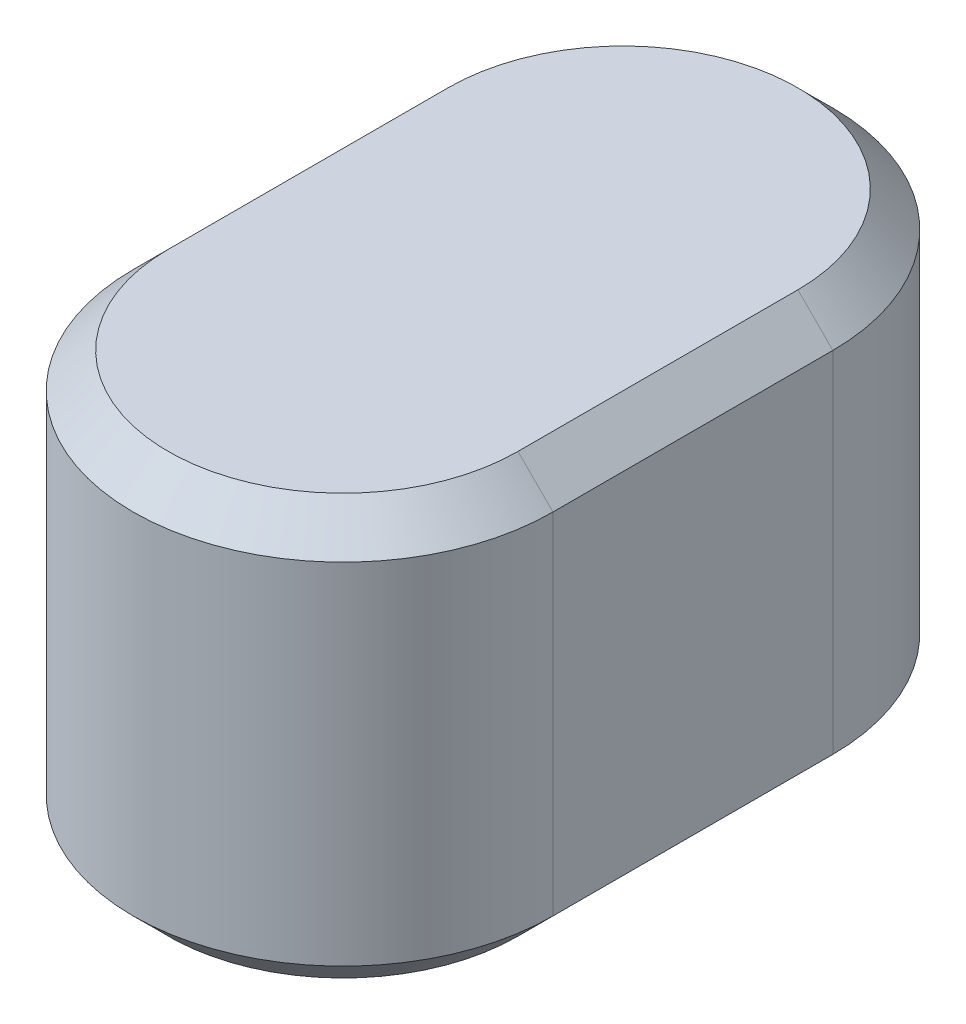
ISO-10303-21;
HEADER;
FILE_DESCRIPTION(('STEP AP214'),'2;1');
FILE_NAME('part.step','',(''),(''),'','','');
FILE_SCHEMA(('AUTOMOTIVE_DESIGN { 1 0 10303 214 1 1 1 1 }'));
ENDSEC;
DATA;
#1=APPLICATION_CONTEXT('core data for automotive mechanical design processes');
#2=APPLICATION_PROTOCOL_DEFINITION('international standard','automotive_design',2000,#1);
#3=PRODUCT_CONTEXT('',#1,'mechanical');
#4=PRODUCT('Part','Part','',(#3));
#5=PRODUCT_RELATED_PRODUCT_CATEGORY('part','',(#4));
#6=PRODUCT_DEFINITION_FORMATION('','',#4);
#7=PRODUCT_DEFINITION_CONTEXT('part definition',#1,'design');
#8=PRODUCT_DEFINITION('design','',#6,#7);
#9=PRODUCT_DEFINITION_SHAPE('','',#8);
#10=(LENGTH_UNIT() NAMED_UNIT(*) SI_UNIT(.MILLI.,.METRE.));
#11=(NAMED_UNIT(*) PLANE_ANGLE_UNIT() SI_UNIT($,.RADIAN.));
#12=(NAMED_UNIT(*) SI_UNIT($,.STERADIAN.) SOLID_ANGLE_UNIT());
#13=UNCERTAINTY_MEASURE_WITH_UNIT(LENGTH_MEASURE(1.E-05),#10,'distance_accuracy_value','');
#14=(GEOMETRIC_REPRESENTATION_CONTEXT(3) GLOBAL_UNCERTAINTY_ASSIGNED_CONTEXT((#13)) GLOBAL_UNIT_ASSIGNED_CONTEXT((#10,
#11,#12)) REPRESENTATION_CONTEXT('',''));
#15=CARTESIAN_POINT('',(0.,0.,0.));
#16=DIRECTION('',(0.,0.,1.));
#17=DIRECTION('',(1.,0.,0.));
#18=AXIS2_PLACEMENT_3D('',#15,#16,#17);
#19=CARTESIAN_POINT('',(0.,12.,0.));
#20=DIRECTION('',(0.,-1.,0.));
#21=DIRECTION('',(0.,0.,-1.));
#22=AXIS2_PLACEMENT_3D('',#19,#20,#21);
#23=CYLINDRICAL_SURFACE('',#22,6.);
#24=DIRECTION('',(0.,-1.,0.));
#25=VECTOR('',#24,1.);
#26=CARTESIAN_POINT('',(-6.,12.,0.));
#27=LINE('',#26,#25);
#28=CARTESIAN_POINT('',(-6.,11.,0.));
#29=VERTEX_POINT('',#28);
#30=CARTESIAN_POINT('',(-6.,1.,0.));
#31=VERTEX_POINT('',#30);
#32=EDGE_CURVE('E119',#29,#31,#27,.T.);
#33=ORIENTED_EDGE('',*,*,#32,.T.);
#34=CARTESIAN_POINT('',(0.,1.,0.));
#35=DIRECTION('',(0.,-1.,0.));
#36=DIRECTION('',(0.,0.,-1.));
#37=AXIS2_PLACEMENT_3D('',#34,#35,#36);
#38=CIRCLE('',#37,6.);
#39=CARTESIAN_POINT('',(6.,1.,0.));
#40=VERTEX_POINT('',#39);
#41=EDGE_CURVE('E126',#31,#40,#38,.F.);
#42=ORIENTED_EDGE('',*,*,#41,.T.);
#43=DIRECTION('',(0.,-1.,0.));
#44=VECTOR('',#43,1.);
#45=CARTESIAN_POINT('',(6.,12.,0.));
#46=LINE('',#45,#44);
#47=CARTESIAN_POINT('',(6.,11.,0.));
#48=VERTEX_POINT('',#47);
#49=EDGE_CURVE('E121',#48,#40,#46,.T.);
#50=ORIENTED_EDGE('',*,*,#49,.F.);
#51=CARTESIAN_POINT('',(0.,11.,0.));
#52=DIRECTION('',(0.,-1.,0.));
#53=DIRECTION('',(0.,0.,-1.));
#54=AXIS2_PLACEMENT_3D('',#51,#52,#53);
#55=CIRCLE('',#54,6.);
#56=EDGE_CURVE('E117',#48,#29,#55,.T.);
#57=ORIENTED_EDGE('',*,*,#56,.T.);
#58=EDGE_LOOP('',(#33,#42,#50,#57));
#59=FACE_BOUND('',#58,.T.);
#60=ADVANCED_FACE('F45',(#59),#23,.T.);
#61=CARTESIAN_POINT('',(6.,12.,0.));
#62=DIRECTION('',(-1.,0.,0.));
#63=DIRECTION('',(0.,0.,1.));
#64=AXIS2_PLACEMENT_3D('',#61,#62,#63);
#65=PLANE('',#64);
#66=ORIENTED_EDGE('',*,*,#49,.T.);
#67=DIRECTION('',(0.,0.,-1.));
#68=VECTOR('',#67,1.);
#69=CARTESIAN_POINT('',(6.,1.,-8.));
#70=LINE('',#69,#68);
#71=CARTESIAN_POINT('',(6.,1.,-8.));
#72=VERTEX_POINT('',#71);
#73=EDGE_CURVE('E192',#40,#72,#70,.T.);
#74=ORIENTED_EDGE('',*,*,#73,.T.);
#75=DIRECTION('',(0.,-1.,0.));
#76=VECTOR('',#75,1.);
#77=CARTESIAN_POINT('',(6.,12.,-8.));
#78=LINE('',#77,#76);
#79=CARTESIAN_POINT('',(6.,11.,-8.));
#80=VERTEX_POINT('',#79);
#81=EDGE_CURVE('E233',#80,#72,#78,.T.);
#82=ORIENTED_EDGE('',*,*,#81,.F.);
#83=DIRECTION('',(0.,0.,1.));
#84=VECTOR('',#83,1.);
#85=CARTESIAN_POINT('',(6.,11.,0.));
#86=LINE('',#85,#84);
#87=EDGE_CURVE('E214',#80,#48,#86,.T.);
#88=ORIENTED_EDGE('',*,*,#87,.T.);
#89=EDGE_LOOP('',(#66,#74,#82,#88));
#90=FACE_BOUND('',#89,.T.);
#91=ADVANCED_FACE('F235',(#90),#65,.F.);
#92=CARTESIAN_POINT('',(0.,12.,-8.));
#93=DIRECTION('',(0.,-1.,0.));
#94=DIRECTION('',(0.,0.,-1.));
#95=AXIS2_PLACEMENT_3D('',#92,#93,#94);
#96=CYLINDRICAL_SURFACE('',#95,6.);
#97=ORIENTED_EDGE('',*,*,#81,.T.);
#98=CARTESIAN_POINT('',(0.,1.,-8.));
#99=DIRECTION('',(0.,-1.,0.));
#100=DIRECTION('',(0.,0.,-1.));
#101=AXIS2_PLACEMENT_3D('',#98,#99,#100);
#102=CIRCLE('',#101,6.);
#103=CARTESIAN_POINT('',(-6.,1.,-8.));
#104=VERTEX_POINT('',#103);
#105=EDGE_CURVE('E187',#72,#104,#102,.F.);
#106=ORIENTED_EDGE('',*,*,#105,.T.);
#107=DIRECTION('',(0.,-1.,0.));
#108=VECTOR('',#107,1.);
#109=CARTESIAN_POINT('',(-6.,12.,-8.));
#110=LINE('',#109,#108);
#111=CARTESIAN_POINT('',(-6.,11.,-8.));
#112=VERTEX_POINT('',#111);
#113=EDGE_CURVE('E139',#112,#104,#110,.T.);
#114=ORIENTED_EDGE('',*,*,#113,.F.);
#115=CARTESIAN_POINT('',(0.,11.,-8.));
#116=DIRECTION('',(0.,-1.,0.));
#117=DIRECTION('',(0.,0.,-1.));
#118=AXIS2_PLACEMENT_3D('',#115,#116,#117);
#119=CIRCLE('',#118,6.);
#120=EDGE_CURVE('E209',#112,#80,#119,.T.);
#121=ORIENTED_EDGE('',*,*,#120,.T.);
#122=EDGE_LOOP('',(#97,#106,#114,#121));
#123=FACE_BOUND('',#122,.T.);
#124=ADVANCED_FACE('F232',(#123),#96,.T.);
#125=CARTESIAN_POINT('',(-6.,12.,0.));
#126=DIRECTION('',(1.,0.,0.));
#127=DIRECTION('',(0.,0.,-1.));
#128=AXIS2_PLACEMENT_3D('',#125,#126,#127);
#129=PLANE('',#128);
#130=ORIENTED_EDGE('',*,*,#113,.T.);
#131=DIRECTION('',(0.,0.,1.));
#132=VECTOR('',#131,1.);
#133=CARTESIAN_POINT('',(-6.,1.,0.));
#134=LINE('',#133,#132);
#135=EDGE_CURVE('E137',#104,#31,#134,.T.);
#136=ORIENTED_EDGE('',*,*,#135,.T.);
#137=ORIENTED_EDGE('',*,*,#32,.F.);
#138=DIRECTION('',(0.,0.,-1.));
#139=VECTOR('',#138,1.);
#140=CARTESIAN_POINT('',(-6.,11.,0.));
#141=LINE('',#140,#139);
#142=EDGE_CURVE('E134',#29,#112,#141,.T.);
#143=ORIENTED_EDGE('',*,*,#142,.T.);
#144=EDGE_LOOP('',(#130,#136,#137,#143));
#145=FACE_BOUND('',#144,.T.);
#146=ADVANCED_FACE('F133',(#145),#129,.F.);
#147=CARTESIAN_POINT('',(0.,12.,0.));
#148=DIRECTION('',(0.,-1.,0.));
#149=DIRECTION('',(0.,0.,-1.));
#150=AXIS2_PLACEMENT_3D('',#147,#148,#149);
#151=PLANE('',#150);
#152=CARTESIAN_POINT('',(0.,12.,-8.));
#153=DIRECTION('',(0.,-1.,0.));
#154=DIRECTION('',(0.,0.,-1.));
#155=AXIS2_PLACEMENT_3D('',#152,#153,#154);
#156=CIRCLE('',#155,5.);
#157=CARTESIAN_POINT('',(5.,12.,-8.));
#158=VERTEX_POINT('',#157);
#159=CARTESIAN_POINT('',(-5.,12.,-8.));
#160=VERTEX_POINT('',#159);
#161=EDGE_CURVE('E71',#158,#160,#156,.F.);
#162=ORIENTED_EDGE('',*,*,#161,.T.);
#163=DIRECTION('',(0.,0.,1.));
#164=VECTOR('',#163,1.);
#165=CARTESIAN_POINT('',(-5.,12.,0.));
#166=LINE('',#165,#164);
#167=CARTESIAN_POINT('',(-5.,12.,0.));
#168=VERTEX_POINT('',#167);
#169=EDGE_CURVE('E11',#160,#168,#166,.T.);
#170=ORIENTED_EDGE('',*,*,#169,.T.);
#171=CARTESIAN_POINT('',(0.,12.,0.));
#172=DIRECTION('',(0.,-1.,0.));
#173=DIRECTION('',(0.,0.,-1.));
#174=AXIS2_PLACEMENT_3D('',#171,#172,#173);
#175=CIRCLE('',#174,5.);
#176=CARTESIAN_POINT('',(5.,12.,0.));
#177=VERTEX_POINT('',#176);
#178=EDGE_CURVE('E56',#168,#177,#175,.F.);
#179=ORIENTED_EDGE('',*,*,#178,.T.);
#180=DIRECTION('',(0.,0.,-1.));
#181=VECTOR('',#180,1.);
#182=CARTESIAN_POINT('',(5.,12.,0.));
#183=LINE('',#182,#181);
#184=EDGE_CURVE('E219',#177,#158,#183,.T.);
#185=ORIENTED_EDGE('',*,*,#184,.T.);
#186=EDGE_LOOP('',(#162,#170,#179,#185));
#187=FACE_BOUND('',#186,.T.);
#188=ADVANCED_FACE('F225',(#187),#151,.F.);
#189=CARTESIAN_POINT('',(0.,0.,0.));
#190=DIRECTION('',(0.,-1.,0.));
#191=DIRECTION('',(0.,0.,-1.));
#192=AXIS2_PLACEMENT_3D('',#189,#190,#191);
#193=PLANE('',#192);
#194=CARTESIAN_POINT('',(0.,0.,0.));
#195=DIRECTION('',(0.,-1.,0.));
#196=DIRECTION('',(0.,0.,-1.));
#197=AXIS2_PLACEMENT_3D('',#194,#195,#196);
#198=CIRCLE('',#197,5.);
#199=CARTESIAN_POINT('',(5.,0.,0.));
#200=VERTEX_POINT('',#199);
#201=CARTESIAN_POINT('',(-5.,0.,0.));
#202=VERTEX_POINT('',#201);
#203=EDGE_CURVE('E199',#200,#202,#198,.T.);
#204=ORIENTED_EDGE('',*,*,#203,.T.);
#205=DIRECTION('',(0.,0.,-1.));
#206=VECTOR('',#205,1.);
#207=CARTESIAN_POINT('',(-5.,0.,-8.));
#208=LINE('',#207,#206);
#209=CARTESIAN_POINT('',(-5.,0.,-8.));
#210=VERTEX_POINT('',#209);
#211=EDGE_CURVE('E127',#202,#210,#208,.T.);
#212=ORIENTED_EDGE('',*,*,#211,.T.);
#213=CARTESIAN_POINT('',(0.,0.,-8.));
#214=DIRECTION('',(0.,-1.,0.));
#215=DIRECTION('',(0.,0.,-1.));
#216=AXIS2_PLACEMENT_3D('',#213,#214,#215);
#217=CIRCLE('',#216,5.);
#218=CARTESIAN_POINT('',(5.,0.,-8.));
#219=VERTEX_POINT('',#218);
#220=EDGE_CURVE('E185',#210,#219,#217,.T.);
#221=ORIENTED_EDGE('',*,*,#220,.T.);
#222=DIRECTION('',(0.,0.,1.));
#223=VECTOR('',#222,1.);
#224=CARTESIAN_POINT('',(5.,0.,0.));
#225=LINE('',#224,#223);
#226=EDGE_CURVE('E193',#219,#200,#225,.T.);
#227=ORIENTED_EDGE('',*,*,#226,.T.);
#228=EDGE_LOOP('',(#204,#212,#221,#227));
#229=FACE_BOUND('',#228,.T.);
#230=ADVANCED_FACE('F263',(#229),#193,.T.);
#231=CARTESIAN_POINT('',(6.,1.,0.));
#232=DIRECTION('',(0.707106781186547,-0.707106781186547,0.));
#233=DIRECTION('',(0.,0.,1.));
#234=AXIS2_PLACEMENT_3D('',#231,#232,#233);
#235=PLANE('',#234);
#236=DIRECTION('',(0.707106781186547,0.707106781186547,0.));
#237=VECTOR('',#236,1.);
#238=CARTESIAN_POINT('',(5.,0.,0.));
#239=LINE('',#238,#237);
#240=EDGE_CURVE('E169',#200,#40,#239,.T.);
#241=ORIENTED_EDGE('',*,*,#240,.F.);
#242=ORIENTED_EDGE('',*,*,#226,.F.);
#243=DIRECTION('',(-0.707106781186547,-0.707106781186547,0.));
#244=VECTOR('',#243,1.);
#245=CARTESIAN_POINT('',(6.,1.,-8.));
#246=LINE('',#245,#244);
#247=EDGE_CURVE('E140',#72,#219,#246,.T.);
#248=ORIENTED_EDGE('',*,*,#247,.F.);
#249=ORIENTED_EDGE('',*,*,#73,.F.);
#250=EDGE_LOOP('',(#241,#242,#248,#249));
#251=FACE_BOUND('',#250,.T.);
#252=ADVANCED_FACE('F191',(#251),#235,.T.);
#253=CARTESIAN_POINT('',(0.,1.,-8.));
#254=DIRECTION('',(0.,1.,0.));
#255=DIRECTION('',(0.,0.,1.));
#256=AXIS2_PLACEMENT_3D('',#253,#254,#255);
#257=CONICAL_SURFACE('',#256,6.,0.785398163397448);
#258=ORIENTED_EDGE('',*,*,#247,.T.);
#259=ORIENTED_EDGE('',*,*,#220,.F.);
#260=DIRECTION('',(0.707106781186547,-0.707106781186547,0.));
#261=VECTOR('',#260,1.);
#262=CARTESIAN_POINT('',(-6.,1.,-8.));
#263=LINE('',#262,#261);
#264=EDGE_CURVE('E162',#104,#210,#263,.T.);
#265=ORIENTED_EDGE('',*,*,#264,.F.);
#266=ORIENTED_EDGE('',*,*,#105,.F.);
#267=EDGE_LOOP('',(#258,#259,#265,#266));
#268=FACE_BOUND('',#267,.T.);
#269=ADVANCED_FACE('F183',(#268),#257,.T.);
#270=CARTESIAN_POINT('',(0.,1.,0.));
#271=DIRECTION('',(0.,1.,0.));
#272=DIRECTION('',(0.,0.,1.));
#273=AXIS2_PLACEMENT_3D('',#270,#271,#272);
#274=CONICAL_SURFACE('',#273,6.,0.785398163397448);
#275=ORIENTED_EDGE('',*,*,#240,.T.);
#276=ORIENTED_EDGE('',*,*,#41,.F.);
#277=DIRECTION('',(-0.707106781186547,0.707106781186547,0.));
#278=VECTOR('',#277,1.);
#279=CARTESIAN_POINT('',(-5.,0.,0.));
#280=LINE('',#279,#278);
#281=EDGE_CURVE('E158',#202,#31,#280,.T.);
#282=ORIENTED_EDGE('',*,*,#281,.F.);
#283=ORIENTED_EDGE('',*,*,#203,.F.);
#284=EDGE_LOOP('',(#275,#276,#282,#283));
#285=FACE_BOUND('',#284,.T.);
#286=ADVANCED_FACE('F244',(#285),#274,.T.);
#287=CARTESIAN_POINT('',(-6.,1.,0.));
#288=DIRECTION('',(-0.707106781186547,-0.707106781186547,0.));
#289=DIRECTION('',(0.,0.,-1.));
#290=AXIS2_PLACEMENT_3D('',#287,#288,#289);
#291=PLANE('',#290);
#292=ORIENTED_EDGE('',*,*,#264,.T.);
#293=ORIENTED_EDGE('',*,*,#211,.F.);
#294=ORIENTED_EDGE('',*,*,#281,.T.);
#295=ORIENTED_EDGE('',*,*,#135,.F.);
#296=EDGE_LOOP('',(#292,#293,#294,#295));
#297=FACE_BOUND('',#296,.T.);
#298=ADVANCED_FACE('F242',(#297),#291,.T.);
#299=CARTESIAN_POINT('',(5.,12.,0.));
#300=DIRECTION('',(-0.707106781186548,-0.707106781186548,0.));
#301=DIRECTION('',(0.,0.,-1.));
#302=AXIS2_PLACEMENT_3D('',#299,#300,#301);
#303=PLANE('',#302);
#304=DIRECTION('',(-0.707106781186548,0.707106781186548,0.));
#305=VECTOR('',#304,1.);
#306=CARTESIAN_POINT('',(6.,11.,0.));
#307=LINE('',#306,#305);
#308=EDGE_CURVE('E151',#48,#177,#307,.T.);
#309=ORIENTED_EDGE('',*,*,#308,.F.);
#310=ORIENTED_EDGE('',*,*,#87,.F.);
#311=DIRECTION('',(0.707106781186548,-0.707106781186548,0.));
#312=VECTOR('',#311,1.);
#313=CARTESIAN_POINT('',(5.,12.,-8.));
#314=LINE('',#313,#312);
#315=EDGE_CURVE('E50',#158,#80,#314,.T.);
#316=ORIENTED_EDGE('',*,*,#315,.F.);
#317=ORIENTED_EDGE('',*,*,#184,.F.);
#318=EDGE_LOOP('',(#309,#310,#316,#317));
#319=FACE_BOUND('',#318,.T.);
#320=ADVANCED_FACE('F48',(#319),#303,.F.);
#321=CARTESIAN_POINT('',(0.,12.,-8.));
#322=DIRECTION('',(0.,-1.,0.));
#323=DIRECTION('',(0.,0.,-1.));
#324=AXIS2_PLACEMENT_3D('',#321,#322,#323);
#325=CONICAL_SURFACE('',#324,5.,0.785398163397448);
#326=ORIENTED_EDGE('',*,*,#315,.T.);
#327=ORIENTED_EDGE('',*,*,#120,.F.);
#328=DIRECTION('',(-0.707106781186548,-0.707106781186548,0.));
#329=VECTOR('',#328,1.);
#330=CARTESIAN_POINT('',(-5.,12.,-8.));
#331=LINE('',#330,#329);
#332=EDGE_CURVE('E143',#160,#112,#331,.T.);
#333=ORIENTED_EDGE('',*,*,#332,.F.);
#334=ORIENTED_EDGE('',*,*,#161,.F.);
#335=EDGE_LOOP('',(#326,#327,#333,#334));
#336=FACE_BOUND('',#335,.T.);
#337=ADVANCED_FACE('F228',(#336),#325,.T.);
#338=CARTESIAN_POINT('',(0.,12.,0.));
#339=DIRECTION('',(0.,-1.,0.));
#340=DIRECTION('',(0.,0.,-1.));
#341=AXIS2_PLACEMENT_3D('',#338,#339,#340);
#342=CONICAL_SURFACE('',#341,5.,0.785398163397448);
#343=ORIENTED_EDGE('',*,*,#308,.T.);
#344=ORIENTED_EDGE('',*,*,#178,.F.);
#345=DIRECTION('',(0.707106781186548,0.707106781186548,0.));
#346=VECTOR('',#345,1.);
#347=CARTESIAN_POINT('',(-6.,11.,0.));
#348=LINE('',#347,#346);
#349=EDGE_CURVE('E64',#29,#168,#348,.T.);
#350=ORIENTED_EDGE('',*,*,#349,.F.);
#351=ORIENTED_EDGE('',*,*,#56,.F.);
#352=EDGE_LOOP('',(#343,#344,#350,#351));
#353=FACE_BOUND('',#352,.T.);
#354=ADVANCED_FACE('F147',(#353),#342,.T.);
#355=CARTESIAN_POINT('',(-5.,12.,0.));
#356=DIRECTION('',(0.707106781186548,-0.707106781186548,0.));
#357=DIRECTION('',(0.,0.,1.));
#358=AXIS2_PLACEMENT_3D('',#355,#356,#357);
#359=PLANE('',#358);
#360=ORIENTED_EDGE('',*,*,#332,.T.);
#361=ORIENTED_EDGE('',*,*,#142,.F.);
#362=ORIENTED_EDGE('',*,*,#349,.T.);
#363=ORIENTED_EDGE('',*,*,#169,.F.);
#364=EDGE_LOOP('',(#360,#361,#362,#363));
#365=FACE_BOUND('',#364,.T.);
#366=ADVANCED_FACE('F142',(#365),#359,.F.);
#367=CLOSED_SHELL('',(#60,#91,#124,#146,#188,#230,#252,#269,#286,#298,#320,#337,#354,#366));
#368=MANIFOLD_SOLID_BREP('B2',#367);
#369=ADVANCED_BREP_SHAPE_REPRESENTATION('',(#18,#368),#14);
#370=SHAPE_DEFINITION_REPRESENTATION(#9,#369);
ENDSEC;
END-ISO-10303-21;
